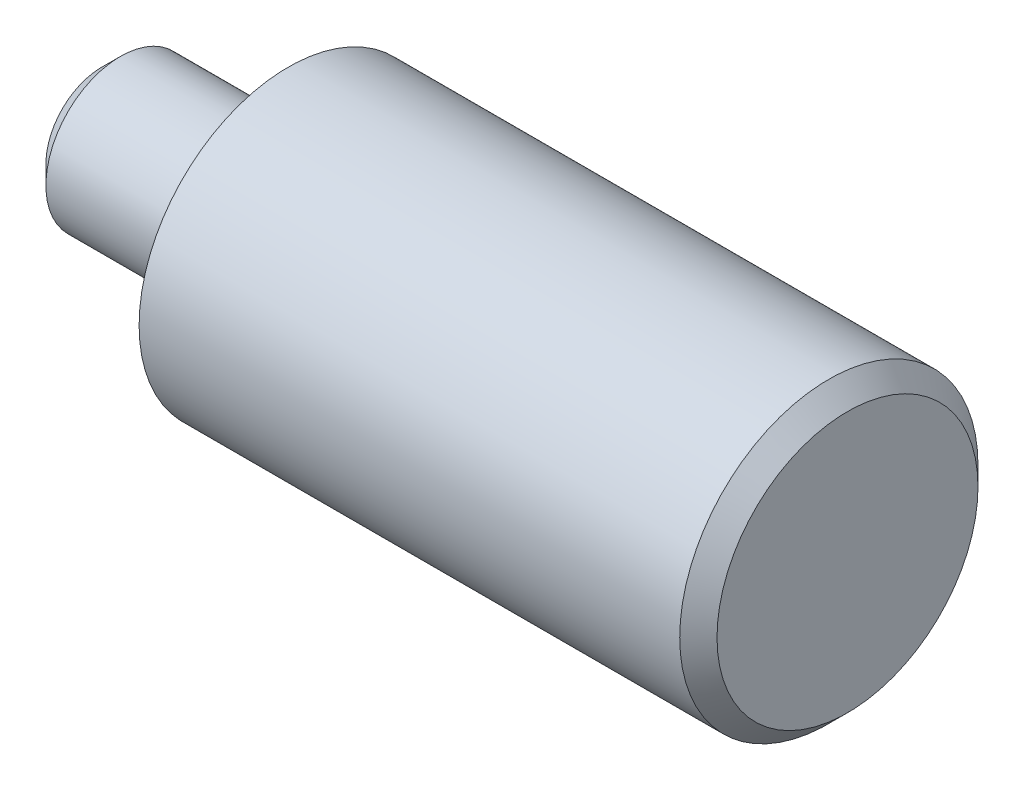
ISO-10303-21;
HEADER;
FILE_DESCRIPTION(('STEP AP214'),'2;1');
FILE_NAME('part.step','',(''),(''),'','','');
FILE_SCHEMA(('AUTOMOTIVE_DESIGN { 1 0 10303 214 1 1 1 1 }'));
ENDSEC;
DATA;
#1=APPLICATION_CONTEXT('core data for automotive mechanical design processes');
#2=APPLICATION_PROTOCOL_DEFINITION('international standard','automotive_design',2000,#1);
#3=PRODUCT_CONTEXT('',#1,'mechanical');
#4=PRODUCT('Part','Part','',(#3));
#5=PRODUCT_RELATED_PRODUCT_CATEGORY('part','',(#4));
#6=PRODUCT_DEFINITION_FORMATION('','',#4);
#7=PRODUCT_DEFINITION_CONTEXT('part definition',#1,'design');
#8=PRODUCT_DEFINITION('design','',#6,#7);
#9=PRODUCT_DEFINITION_SHAPE('','',#8);
#10=(LENGTH_UNIT() NAMED_UNIT(*) SI_UNIT(.MILLI.,.METRE.));
#11=(NAMED_UNIT(*) PLANE_ANGLE_UNIT() SI_UNIT($,.RADIAN.));
#12=(NAMED_UNIT(*) SI_UNIT($,.STERADIAN.) SOLID_ANGLE_UNIT());
#13=UNCERTAINTY_MEASURE_WITH_UNIT(LENGTH_MEASURE(1.E-05),#10,'distance_accuracy_value','');
#14=(GEOMETRIC_REPRESENTATION_CONTEXT(3) GLOBAL_UNCERTAINTY_ASSIGNED_CONTEXT((#13)) GLOBAL_UNIT_ASSIGNED_CONTEXT((#10,
#11,#12)) REPRESENTATION_CONTEXT('',''));
#15=CARTESIAN_POINT('',(0.,0.,0.));
#16=DIRECTION('',(0.,0.,1.));
#17=DIRECTION('',(1.,0.,0.));
#18=AXIS2_PLACEMENT_3D('',#15,#16,#17);
#19=CARTESIAN_POINT('',(0.,0.,0.));
#20=DIRECTION('',(-1.,0.,0.));
#21=DIRECTION('',(0.,0.,1.));
#22=AXIS2_PLACEMENT_3D('',#19,#20,#21);
#23=PLANE('',#22);
#24=CARTESIAN_POINT('',(0.,0.,0.));
#25=DIRECTION('',(-1.,0.,0.));
#26=DIRECTION('',(0.,0.,1.));
#27=AXIS2_PLACEMENT_3D('',#24,#25,#26);
#28=CIRCLE('',#27,6.99999999999998);
#29=CARTESIAN_POINT('',(0.,0.,6.99999999999998));
#30=VERTEX_POINT('',#29);
#31=EDGE_CURVE('E51',#30,#30,#28,.F.);
#32=ORIENTED_EDGE('',*,*,#31,.T.);
#33=EDGE_LOOP('',(#32));
#34=FACE_BOUND('',#33,.T.);
#35=ADVANCED_FACE('F39',(#34),#23,.F.);
#36=CARTESIAN_POINT('',(-114.784060063965,0.,0.));
#37=DIRECTION('',(-1.,0.,0.));
#38=DIRECTION('',(0.,0.,1.));
#39=AXIS2_PLACEMENT_3D('',#36,#37,#38);
#40=CYLINDRICAL_SURFACE('',#39,8.);
#41=CARTESIAN_POINT('',(-1.00000000000001,0.,0.));
#42=DIRECTION('',(-1.,0.,0.));
#43=DIRECTION('',(0.,0.,1.));
#44=AXIS2_PLACEMENT_3D('',#41,#42,#43);
#45=CIRCLE('',#44,8.);
#46=CARTESIAN_POINT('',(-1.00000000000001,0.,8.));
#47=VERTEX_POINT('',#46);
#48=EDGE_CURVE('E55',#47,#47,#45,.T.);
#49=ORIENTED_EDGE('',*,*,#48,.T.);
#50=EDGE_LOOP('',(#49));
#51=FACE_BOUND('',#50,.T.);
#52=CARTESIAN_POINT('',(-30.,0.,0.));
#53=DIRECTION('',(-1.,0.,0.));
#54=DIRECTION('',(0.,0.,1.));
#55=AXIS2_PLACEMENT_3D('',#52,#53,#54);
#56=CIRCLE('',#55,8.);
#57=CARTESIAN_POINT('',(-30.,0.,8.));
#58=VERTEX_POINT('',#57);
#59=EDGE_CURVE('E60',#58,#58,#56,.T.);
#60=ORIENTED_EDGE('',*,*,#59,.F.);
#61=EDGE_LOOP('',(#60));
#62=FACE_BOUND('',#61,.T.);
#63=ADVANCED_FACE('F99',(#51,#62),#40,.T.);
#64=CARTESIAN_POINT('',(-30.,8.,0.));
#65=DIRECTION('',(1.,0.,0.));
#66=DIRECTION('',(0.,0.,-1.));
#67=AXIS2_PLACEMENT_3D('',#64,#65,#66);
#68=PLANE('',#67);
#69=ORIENTED_EDGE('',*,*,#59,.T.);
#70=EDGE_LOOP('',(#69));
#71=FACE_BOUND('',#70,.T.);
#72=CARTESIAN_POINT('',(-30.,0.,0.));
#73=DIRECTION('',(1.,0.,0.));
#74=DIRECTION('',(0.,0.,-1.));
#75=AXIS2_PLACEMENT_3D('',#72,#73,#74);
#76=CIRCLE('',#75,3.);
#77=CARTESIAN_POINT('',(-30.,0.,-3.));
#78=VERTEX_POINT('',#77);
#79=EDGE_CURVE('E69',#78,#78,#76,.T.);
#80=ORIENTED_EDGE('',*,*,#79,.T.);
#81=EDGE_LOOP('',(#80));
#82=FACE_BOUND('',#81,.T.);
#83=ADVANCED_FACE('F73',(#71,#82),#68,.F.);
#84=CARTESIAN_POINT('',(-1.00000000000001,0.,0.));
#85=DIRECTION('',(-1.,0.,0.));
#86=DIRECTION('',(0.,0.,1.));
#87=AXIS2_PLACEMENT_3D('',#84,#85,#86);
#88=CONICAL_SURFACE('',#87,8.,0.785398163397449);
#89=ORIENTED_EDGE('',*,*,#31,.F.);
#90=EDGE_LOOP('',(#89));
#91=FACE_BOUND('',#90,.T.);
#92=ORIENTED_EDGE('',*,*,#48,.F.);
#93=EDGE_LOOP('',(#92));
#94=FACE_BOUND('',#93,.T.);
#95=ADVANCED_FACE('F85',(#91,#94),#88,.T.);
#96=CARTESIAN_POINT('',(-31.,3.,0.));
#97=DIRECTION('',(-1.,0.,0.));
#98=DIRECTION('',(0.,0.,1.));
#99=AXIS2_PLACEMENT_3D('',#96,#97,#98);
#100=PLANE('',#99);
#101=CARTESIAN_POINT('',(-31.,0.,0.));
#102=DIRECTION('',(1.,0.,0.));
#103=DIRECTION('',(0.,0.,-1.));
#104=AXIS2_PLACEMENT_3D('',#101,#102,#103);
#105=CIRCLE('',#104,3.);
#106=CARTESIAN_POINT('',(-31.,0.,-3.));
#107=VERTEX_POINT('',#106);
#108=EDGE_CURVE('E66',#107,#107,#105,.T.);
#109=ORIENTED_EDGE('',*,*,#108,.F.);
#110=EDGE_LOOP('',(#109));
#111=FACE_BOUND('',#110,.T.);
#112=CARTESIAN_POINT('',(-31.,0.,0.));
#113=DIRECTION('',(1.,0.,0.));
#114=DIRECTION('',(0.,0.,-1.));
#115=AXIS2_PLACEMENT_3D('',#112,#113,#114);
#116=CIRCLE('',#115,4.);
#117=CARTESIAN_POINT('',(-31.,0.,-4.));
#118=VERTEX_POINT('',#117);
#119=EDGE_CURVE('E63',#118,#118,#116,.T.);
#120=ORIENTED_EDGE('',*,*,#119,.T.);
#121=EDGE_LOOP('',(#120));
#122=FACE_BOUND('',#121,.T.);
#123=ADVANCED_FACE('F79',(#111,#122),#100,.F.);
#124=CARTESIAN_POINT('',(0.,0.,0.));
#125=DIRECTION('',(1.,0.,0.));
#126=DIRECTION('',(0.,0.,-1.));
#127=AXIS2_PLACEMENT_3D('',#124,#125,#126);
#128=CYLINDRICAL_SURFACE('',#127,3.);
#129=ORIENTED_EDGE('',*,*,#79,.F.);
#130=EDGE_LOOP('',(#129));
#131=FACE_BOUND('',#130,.T.);
#132=ORIENTED_EDGE('',*,*,#108,.T.);
#133=EDGE_LOOP('',(#132));
#134=FACE_BOUND('',#133,.T.);
#135=ADVANCED_FACE('F75',(#131,#134),#128,.T.);
#136=CARTESIAN_POINT('',(-40.,4.,0.));
#137=DIRECTION('',(1.,0.,0.));
#138=DIRECTION('',(0.,0.,-1.));
#139=AXIS2_PLACEMENT_3D('',#136,#137,#138);
#140=PLANE('',#139);
#141=CARTESIAN_POINT('',(-40.,0.,0.));
#142=DIRECTION('',(1.,0.,0.));
#143=DIRECTION('',(0.,0.,-1.));
#144=AXIS2_PLACEMENT_3D('',#141,#142,#143);
#145=CIRCLE('',#144,2.99999999999998);
#146=CARTESIAN_POINT('',(-40.,0.,-2.99999999999998));
#147=VERTEX_POINT('',#146);
#148=EDGE_CURVE('E47',#147,#147,#145,.F.);
#149=ORIENTED_EDGE('',*,*,#148,.T.);
#150=EDGE_LOOP('',(#149));
#151=FACE_BOUND('',#150,.T.);
#152=ADVANCED_FACE('F78',(#151),#140,.F.);
#153=CARTESIAN_POINT('',(-40.,0.,0.));
#154=DIRECTION('',(1.,0.,0.));
#155=DIRECTION('',(0.,0.,-1.));
#156=AXIS2_PLACEMENT_3D('',#153,#154,#155);
#157=CONICAL_SURFACE('',#156,2.99999999999999,0.785398163397447);
#158=CARTESIAN_POINT('',(-39.,0.,0.));
#159=DIRECTION('',(1.,0.,0.));
#160=DIRECTION('',(0.,0.,-1.));
#161=AXIS2_PLACEMENT_3D('',#158,#159,#160);
#162=CIRCLE('',#161,4.);
#163=CARTESIAN_POINT('',(-39.,0.,-4.));
#164=VERTEX_POINT('',#163);
#165=EDGE_CURVE('E10',#164,#164,#162,.T.);
#166=ORIENTED_EDGE('',*,*,#165,.F.);
#167=EDGE_LOOP('',(#166));
#168=FACE_BOUND('',#167,.T.);
#169=ORIENTED_EDGE('',*,*,#148,.F.);
#170=EDGE_LOOP('',(#169));
#171=FACE_BOUND('',#170,.T.);
#172=ADVANCED_FACE('F42',(#168,#171),#157,.T.);
#173=CARTESIAN_POINT('',(-114.784060063965,0.,0.));
#174=DIRECTION('',(-1.,0.,0.));
#175=DIRECTION('',(0.,0.,1.));
#176=AXIS2_PLACEMENT_3D('',#173,#174,#175);
#177=CYLINDRICAL_SURFACE('',#176,4.);
#178=ORIENTED_EDGE('',*,*,#119,.F.);
#179=EDGE_LOOP('',(#178));
#180=FACE_BOUND('',#179,.T.);
#181=ORIENTED_EDGE('',*,*,#165,.T.);
#182=EDGE_LOOP('',(#181));
#183=FACE_BOUND('',#182,.T.);
#184=ADVANCED_FACE('F89',(#180,#183),#177,.T.);
#185=CLOSED_SHELL('',(#35,#63,#83,#95,#123,#135,#152,#172,#184));
#186=MANIFOLD_SOLID_BREP('B2',#185);
#187=ADVANCED_BREP_SHAPE_REPRESENTATION('',(#18,#186),#14);
#188=SHAPE_DEFINITION_REPRESENTATION(#9,#187);
ENDSEC;
END-ISO-10303-21;
